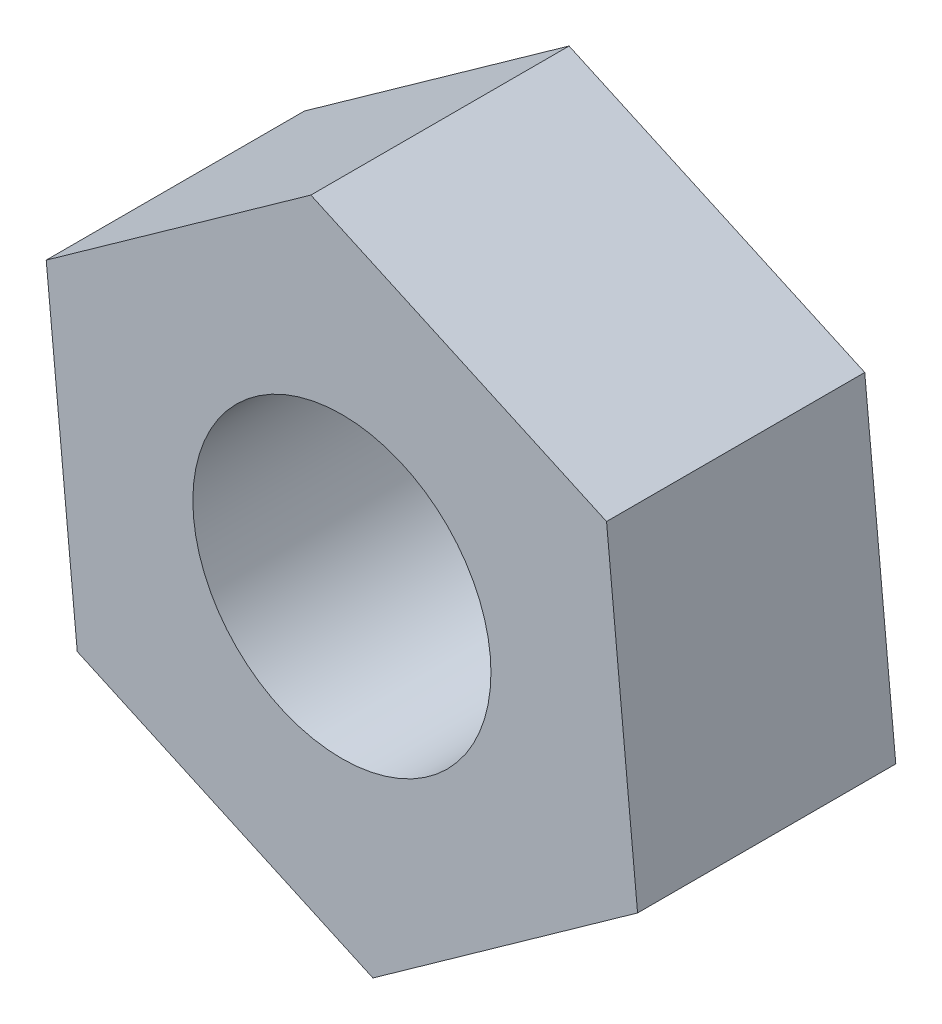
ISO-10303-21;
HEADER;
FILE_DESCRIPTION(('STEP AP214'),'2;1');
FILE_NAME('part.step','',(''),(''),'','','');
FILE_SCHEMA(('AUTOMOTIVE_DESIGN { 1 0 10303 214 1 1 1 1 }'));
ENDSEC;
DATA;
#1=APPLICATION_CONTEXT('core data for automotive mechanical design processes');
#2=APPLICATION_PROTOCOL_DEFINITION('international standard','automotive_design',2000,#1);
#3=PRODUCT_CONTEXT('',#1,'mechanical');
#4=PRODUCT('Part','Part','',(#3));
#5=PRODUCT_RELATED_PRODUCT_CATEGORY('part','',(#4));
#6=PRODUCT_DEFINITION_FORMATION('','',#4);
#7=PRODUCT_DEFINITION_CONTEXT('part definition',#1,'design');
#8=PRODUCT_DEFINITION('design','',#6,#7);
#9=PRODUCT_DEFINITION_SHAPE('','',#8);
#10=(LENGTH_UNIT() NAMED_UNIT(*) SI_UNIT(.MILLI.,.METRE.));
#11=(NAMED_UNIT(*) PLANE_ANGLE_UNIT() SI_UNIT($,.RADIAN.));
#12=(NAMED_UNIT(*) SI_UNIT($,.STERADIAN.) SOLID_ANGLE_UNIT());
#13=UNCERTAINTY_MEASURE_WITH_UNIT(LENGTH_MEASURE(1.E-05),#10,'distance_accuracy_value','');
#14=(GEOMETRIC_REPRESENTATION_CONTEXT(3) GLOBAL_UNCERTAINTY_ASSIGNED_CONTEXT((#13)) GLOBAL_UNIT_ASSIGNED_CONTEXT((#10,
#11,#12)) REPRESENTATION_CONTEXT('',''));
#15=CARTESIAN_POINT('',(0.,0.,0.));
#16=DIRECTION('',(0.,0.,1.));
#17=DIRECTION('',(1.,0.,0.));
#18=AXIS2_PLACEMENT_3D('',#15,#16,#17);
#19=CARTESIAN_POINT('',(0.,0.,5.5));
#20=DIRECTION('',(0.,0.,1.));
#21=DIRECTION('',(1.,0.,0.));
#22=AXIS2_PLACEMENT_3D('',#19,#20,#21);
#23=PLANE('',#22);
#24=DIRECTION('',(0.0954979079820055,-0.995429630647521,0.));
#25=VECTOR('',#24,1.);
#26=CARTESIAN_POINT('',(-6.29813941430023,2.87288587510386,5.5));
#27=LINE('',#26,#25);
#28=CARTESIAN_POINT('',(-6.29813941430023,2.87288587510386,5.5));
#29=VERTEX_POINT('',#28);
#30=CARTESIAN_POINT('',(-5.63706185716355,-4.01790579180811,5.5));
#31=VERTEX_POINT('',#30);
#32=EDGE_CURVE('E131',#29,#31,#27,.T.);
#33=ORIENTED_EDGE('',*,*,#32,.T.);
#34=DIRECTION('',(0.909816301811517,-0.415011201003075,0.));
#35=VECTOR('',#34,1.);
#36=CARTESIAN_POINT('',(-5.63706185716355,-4.01790579180811,5.5));
#37=LINE('',#36,#35);
#38=CARTESIAN_POINT('',(0.661077557136677,-6.89079166691198,5.5));
#39=VERTEX_POINT('',#38);
#40=EDGE_CURVE('E89',#31,#39,#37,.T.);
#41=ORIENTED_EDGE('',*,*,#40,.T.);
#42=DIRECTION('',(0.814318393829511,0.580418429644446,0.));
#43=VECTOR('',#42,1.);
#44=CARTESIAN_POINT('',(0.661077557136677,-6.89079166691198,5.5));
#45=LINE('',#44,#43);
#46=CARTESIAN_POINT('',(6.29813941430023,-2.87288587510386,5.5));
#47=VERTEX_POINT('',#46);
#48=EDGE_CURVE('E102',#39,#47,#45,.T.);
#49=ORIENTED_EDGE('',*,*,#48,.T.);
#50=DIRECTION('',(-0.0954979079820056,0.995429630647521,0.));
#51=VECTOR('',#50,1.);
#52=CARTESIAN_POINT('',(6.29813941430023,-2.87288587510386,5.5));
#53=LINE('',#52,#51);
#54=CARTESIAN_POINT('',(5.63706185716355,4.01790579180811,5.5));
#55=VERTEX_POINT('',#54);
#56=EDGE_CURVE('E96',#47,#55,#53,.T.);
#57=ORIENTED_EDGE('',*,*,#56,.T.);
#58=DIRECTION('',(-0.909816301811517,0.415011201003075,0.));
#59=VECTOR('',#58,1.);
#60=CARTESIAN_POINT('',(5.63706185716355,4.01790579180811,5.5));
#61=LINE('',#60,#59);
#62=CARTESIAN_POINT('',(-0.661077557136678,6.89079166691198,5.5));
#63=VERTEX_POINT('',#62);
#64=EDGE_CURVE('E100',#55,#63,#61,.T.);
#65=ORIENTED_EDGE('',*,*,#64,.T.);
#66=DIRECTION('',(-0.814318393829511,-0.580418429644446,0.));
#67=VECTOR('',#66,1.);
#68=CARTESIAN_POINT('',(-0.661077557136678,6.89079166691198,5.5));
#69=LINE('',#68,#67);
#70=EDGE_CURVE('E52',#63,#29,#69,.T.);
#71=ORIENTED_EDGE('',*,*,#70,.T.);
#72=EDGE_LOOP('',(#33,#41,#49,#57,#65,#71));
#73=FACE_BOUND('',#72,.T.);
#74=CARTESIAN_POINT('',(0.,0.,5.5));
#75=DIRECTION('',(0.,0.,1.));
#76=DIRECTION('',(1.,0.,0.));
#77=AXIS2_PLACEMENT_3D('',#74,#75,#76);
#78=CIRCLE('',#77,3.175);
#79=CARTESIAN_POINT('',(3.175,0.,5.5));
#80=VERTEX_POINT('',#79);
#81=EDGE_CURVE('E124',#80,#80,#78,.T.);
#82=ORIENTED_EDGE('',*,*,#81,.F.);
#83=EDGE_LOOP('',(#82));
#84=FACE_BOUND('',#83,.T.);
#85=ADVANCED_FACE('F35',(#73,#84),#23,.T.);
#86=CARTESIAN_POINT('',(0.,0.,0.));
#87=DIRECTION('',(0.,0.,1.));
#88=DIRECTION('',(1.,0.,0.));
#89=AXIS2_PLACEMENT_3D('',#86,#87,#88);
#90=PLANE('',#89);
#91=DIRECTION('',(0.0954979079820055,-0.995429630647521,0.));
#92=VECTOR('',#91,1.);
#93=CARTESIAN_POINT('',(-6.29813941430023,2.87288587510386,0.));
#94=LINE('',#93,#92);
#95=CARTESIAN_POINT('',(-6.29813941430023,2.87288587510386,0.));
#96=VERTEX_POINT('',#95);
#97=CARTESIAN_POINT('',(-5.63706185716355,-4.01790579180811,0.));
#98=VERTEX_POINT('',#97);
#99=EDGE_CURVE('E120',#96,#98,#94,.T.);
#100=ORIENTED_EDGE('',*,*,#99,.F.);
#101=DIRECTION('',(-0.814318393829511,-0.580418429644446,0.));
#102=VECTOR('',#101,1.);
#103=CARTESIAN_POINT('',(-0.661077557136678,6.89079166691198,0.));
#104=LINE('',#103,#102);
#105=CARTESIAN_POINT('',(-0.661077557136678,6.89079166691198,0.));
#106=VERTEX_POINT('',#105);
#107=EDGE_CURVE('E81',#106,#96,#104,.T.);
#108=ORIENTED_EDGE('',*,*,#107,.F.);
#109=DIRECTION('',(-0.909816301811517,0.415011201003075,0.));
#110=VECTOR('',#109,1.);
#111=CARTESIAN_POINT('',(5.63706185716355,4.01790579180811,0.));
#112=LINE('',#111,#110);
#113=CARTESIAN_POINT('',(5.63706185716355,4.01790579180811,0.));
#114=VERTEX_POINT('',#113);
#115=EDGE_CURVE('E75',#114,#106,#112,.T.);
#116=ORIENTED_EDGE('',*,*,#115,.F.);
#117=DIRECTION('',(-0.0954979079820056,0.995429630647521,0.));
#118=VECTOR('',#117,1.);
#119=CARTESIAN_POINT('',(6.29813941430023,-2.87288587510386,0.));
#120=LINE('',#119,#118);
#121=CARTESIAN_POINT('',(6.29813941430023,-2.87288587510386,0.));
#122=VERTEX_POINT('',#121);
#123=EDGE_CURVE('E110',#122,#114,#120,.T.);
#124=ORIENTED_EDGE('',*,*,#123,.F.);
#125=DIRECTION('',(0.814318393829511,0.580418429644446,0.));
#126=VECTOR('',#125,1.);
#127=CARTESIAN_POINT('',(0.661077557136677,-6.89079166691198,0.));
#128=LINE('',#127,#126);
#129=CARTESIAN_POINT('',(0.661077557136677,-6.89079166691198,0.));
#130=VERTEX_POINT('',#129);
#131=EDGE_CURVE('E126',#130,#122,#128,.T.);
#132=ORIENTED_EDGE('',*,*,#131,.F.);
#133=DIRECTION('',(0.909816301811517,-0.415011201003075,0.));
#134=VECTOR('',#133,1.);
#135=CARTESIAN_POINT('',(-5.63706185716355,-4.01790579180811,0.));
#136=LINE('',#135,#134);
#137=EDGE_CURVE('E123',#98,#130,#136,.T.);
#138=ORIENTED_EDGE('',*,*,#137,.F.);
#139=EDGE_LOOP('',(#100,#108,#116,#124,#132,#138));
#140=FACE_BOUND('',#139,.T.);
#141=CARTESIAN_POINT('',(0.,0.,0.));
#142=DIRECTION('',(0.,0.,1.));
#143=DIRECTION('',(1.,0.,0.));
#144=AXIS2_PLACEMENT_3D('',#141,#142,#143);
#145=CIRCLE('',#144,3.175);
#146=CARTESIAN_POINT('',(3.175,0.,0.));
#147=VERTEX_POINT('',#146);
#148=EDGE_CURVE('E224',#147,#147,#145,.T.);
#149=ORIENTED_EDGE('',*,*,#148,.T.);
#150=EDGE_LOOP('',(#149));
#151=FACE_BOUND('',#150,.T.);
#152=ADVANCED_FACE('F140',(#140,#151),#90,.F.);
#153=CARTESIAN_POINT('',(-6.29813941430023,2.87288587510386,5.5));
#154=DIRECTION('',(0.995429630647521,0.0954979079820055,0.));
#155=DIRECTION('',(-0.0954979079820055,0.995429630647521,0.));
#156=AXIS2_PLACEMENT_3D('',#153,#154,#155);
#157=PLANE('',#156);
#158=ORIENTED_EDGE('',*,*,#99,.T.);
#159=DIRECTION('',(0.,0.,-1.));
#160=VECTOR('',#159,1.);
#161=CARTESIAN_POINT('',(-5.63706185716355,-4.01790579180811,5.5));
#162=LINE('',#161,#160);
#163=EDGE_CURVE('E11',#31,#98,#162,.T.);
#164=ORIENTED_EDGE('',*,*,#163,.F.);
#165=ORIENTED_EDGE('',*,*,#32,.F.);
#166=DIRECTION('',(0.,0.,-1.));
#167=VECTOR('',#166,1.);
#168=CARTESIAN_POINT('',(-6.29813941430023,2.87288587510386,5.5));
#169=LINE('',#168,#167);
#170=EDGE_CURVE('E116',#29,#96,#169,.T.);
#171=ORIENTED_EDGE('',*,*,#170,.T.);
#172=EDGE_LOOP('',(#158,#164,#165,#171));
#173=FACE_BOUND('',#172,.T.);
#174=ADVANCED_FACE('F37',(#173),#157,.F.);
#175=CARTESIAN_POINT('',(-5.63706185716355,-4.01790579180811,5.5));
#176=DIRECTION('',(0.415011201003075,0.909816301811517,0.));
#177=DIRECTION('',(-0.909816301811517,0.415011201003075,0.));
#178=AXIS2_PLACEMENT_3D('',#175,#176,#177);
#179=PLANE('',#178);
#180=ORIENTED_EDGE('',*,*,#137,.T.);
#181=DIRECTION('',(0.,0.,-1.));
#182=VECTOR('',#181,1.);
#183=CARTESIAN_POINT('',(0.661077557136677,-6.89079166691198,5.5));
#184=LINE('',#183,#182);
#185=EDGE_CURVE('E44',#39,#130,#184,.T.);
#186=ORIENTED_EDGE('',*,*,#185,.F.);
#187=ORIENTED_EDGE('',*,*,#40,.F.);
#188=ORIENTED_EDGE('',*,*,#163,.T.);
#189=EDGE_LOOP('',(#180,#186,#187,#188));
#190=FACE_BOUND('',#189,.T.);
#191=ADVANCED_FACE('F165',(#190),#179,.F.);
#192=CARTESIAN_POINT('',(0.661077557136677,-6.89079166691198,5.5));
#193=DIRECTION('',(-0.580418429644446,0.814318393829511,0.));
#194=DIRECTION('',(-0.814318393829511,-0.580418429644446,0.));
#195=AXIS2_PLACEMENT_3D('',#192,#193,#194);
#196=PLANE('',#195);
#197=ORIENTED_EDGE('',*,*,#131,.T.);
#198=DIRECTION('',(0.,0.,-1.));
#199=VECTOR('',#198,1.);
#200=CARTESIAN_POINT('',(6.29813941430023,-2.87288587510386,5.5));
#201=LINE('',#200,#199);
#202=EDGE_CURVE('E111',#47,#122,#201,.T.);
#203=ORIENTED_EDGE('',*,*,#202,.F.);
#204=ORIENTED_EDGE('',*,*,#48,.F.);
#205=ORIENTED_EDGE('',*,*,#185,.T.);
#206=EDGE_LOOP('',(#197,#203,#204,#205));
#207=FACE_BOUND('',#206,.T.);
#208=ADVANCED_FACE('F137',(#207),#196,.F.);
#209=CARTESIAN_POINT('',(6.29813941430023,-2.87288587510386,5.5));
#210=DIRECTION('',(-0.995429630647521,-0.0954979079820056,0.));
#211=DIRECTION('',(0.0954979079820056,-0.995429630647521,0.));
#212=AXIS2_PLACEMENT_3D('',#209,#210,#211);
#213=PLANE('',#212);
#214=ORIENTED_EDGE('',*,*,#123,.T.);
#215=DIRECTION('',(0.,0.,-1.));
#216=VECTOR('',#215,1.);
#217=CARTESIAN_POINT('',(5.63706185716355,4.01790579180811,5.5));
#218=LINE('',#217,#216);
#219=EDGE_CURVE('E107',#55,#114,#218,.T.);
#220=ORIENTED_EDGE('',*,*,#219,.F.);
#221=ORIENTED_EDGE('',*,*,#56,.F.);
#222=ORIENTED_EDGE('',*,*,#202,.T.);
#223=EDGE_LOOP('',(#214,#220,#221,#222));
#224=FACE_BOUND('',#223,.T.);
#225=ADVANCED_FACE('F108',(#224),#213,.F.);
#226=CARTESIAN_POINT('',(5.63706185716355,4.01790579180811,5.5));
#227=DIRECTION('',(-0.415011201003075,-0.909816301811517,0.));
#228=DIRECTION('',(0.909816301811517,-0.415011201003075,0.));
#229=AXIS2_PLACEMENT_3D('',#226,#227,#228);
#230=PLANE('',#229);
#231=ORIENTED_EDGE('',*,*,#115,.T.);
#232=DIRECTION('',(0.,0.,-1.));
#233=VECTOR('',#232,1.);
#234=CARTESIAN_POINT('',(-0.661077557136678,6.89079166691198,5.5));
#235=LINE('',#234,#233);
#236=EDGE_CURVE('E112',#63,#106,#235,.T.);
#237=ORIENTED_EDGE('',*,*,#236,.F.);
#238=ORIENTED_EDGE('',*,*,#64,.F.);
#239=ORIENTED_EDGE('',*,*,#219,.T.);
#240=EDGE_LOOP('',(#231,#237,#238,#239));
#241=FACE_BOUND('',#240,.T.);
#242=ADVANCED_FACE('F114',(#241),#230,.F.);
#243=CARTESIAN_POINT('',(-0.661077557136678,6.89079166691198,5.5));
#244=DIRECTION('',(0.580418429644446,-0.814318393829511,0.));
#245=DIRECTION('',(0.814318393829511,0.580418429644446,0.));
#246=AXIS2_PLACEMENT_3D('',#243,#244,#245);
#247=PLANE('',#246);
#248=ORIENTED_EDGE('',*,*,#107,.T.);
#249=ORIENTED_EDGE('',*,*,#170,.F.);
#250=ORIENTED_EDGE('',*,*,#70,.F.);
#251=ORIENTED_EDGE('',*,*,#236,.T.);
#252=EDGE_LOOP('',(#248,#249,#250,#251));
#253=FACE_BOUND('',#252,.T.);
#254=ADVANCED_FACE('F145',(#253),#247,.F.);
#255=CARTESIAN_POINT('',(0.,0.,5.5));
#256=DIRECTION('',(0.,0.,-1.));
#257=DIRECTION('',(-1.,0.,0.));
#258=AXIS2_PLACEMENT_3D('',#255,#256,#257);
#259=CYLINDRICAL_SURFACE('',#258,3.175);
#260=ORIENTED_EDGE('',*,*,#81,.T.);
#261=EDGE_LOOP('',(#260));
#262=FACE_BOUND('',#261,.T.);
#263=ORIENTED_EDGE('',*,*,#148,.F.);
#264=EDGE_LOOP('',(#263));
#265=FACE_BOUND('',#264,.T.);
#266=ADVANCED_FACE('F147',(#262,#265),#259,.F.);
#267=CLOSED_SHELL('',(#85,#152,#174,#191,#208,#225,#242,#254,#266));
#268=MANIFOLD_SOLID_BREP('B2',#267);
#269=ADVANCED_BREP_SHAPE_REPRESENTATION('',(#18,#268),#14);
#270=SHAPE_DEFINITION_REPRESENTATION(#9,#269);
ENDSEC;
END-ISO-10303-21;
